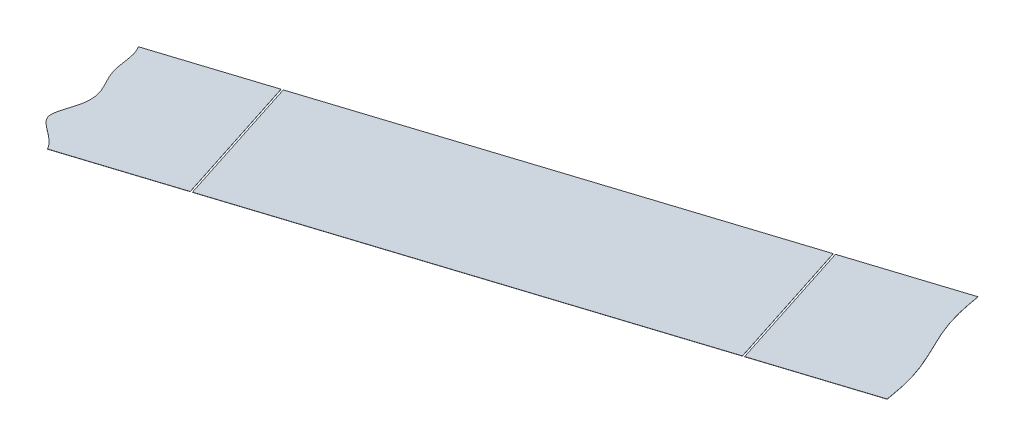
ISO-10303-21;
HEADER;
FILE_DESCRIPTION(('STEP AP214'),'2;1');
FILE_NAME('part.step','',(''),(''),'','','');
FILE_SCHEMA(('AUTOMOTIVE_DESIGN { 1 0 10303 214 1 1 1 1 }'));
ENDSEC;
DATA;
#1=APPLICATION_CONTEXT('core data for automotive mechanical design processes');
#2=APPLICATION_PROTOCOL_DEFINITION('international standard','automotive_design',2000,#1);
#3=PRODUCT_CONTEXT('',#1,'mechanical');
#4=PRODUCT('Part','Part','',(#3));
#5=PRODUCT_RELATED_PRODUCT_CATEGORY('part','',(#4));
#6=PRODUCT_DEFINITION_FORMATION('','',#4);
#7=PRODUCT_DEFINITION_CONTEXT('part definition',#1,'design');
#8=PRODUCT_DEFINITION('design','',#6,#7);
#9=PRODUCT_DEFINITION_SHAPE('','',#8);
#10=(LENGTH_UNIT() NAMED_UNIT(*) SI_UNIT(.MILLI.,.METRE.));
#11=(NAMED_UNIT(*) PLANE_ANGLE_UNIT() SI_UNIT($,.RADIAN.));
#12=(NAMED_UNIT(*) SI_UNIT($,.STERADIAN.) SOLID_ANGLE_UNIT());
#13=UNCERTAINTY_MEASURE_WITH_UNIT(LENGTH_MEASURE(1.E-05),#10,'distance_accuracy_value','');
#14=(GEOMETRIC_REPRESENTATION_CONTEXT(3) GLOBAL_UNCERTAINTY_ASSIGNED_CONTEXT((#13)) GLOBAL_UNIT_ASSIGNED_CONTEXT((#10,
#11,#12)) REPRESENTATION_CONTEXT('',''));
#15=CARTESIAN_POINT('',(0.,0.,0.));
#16=DIRECTION('',(0.,0.,1.));
#17=DIRECTION('',(1.,0.,0.));
#18=AXIS2_PLACEMENT_3D('',#15,#16,#17);
#19=CARTESIAN_POINT('',(719.344625514833,60.3000999940948,-202.533394104968));
#20=DIRECTION('',(0.304317580977551,-0.00396825396825686,0.952562366917996));
#21=DIRECTION('',(0.952569867025211,0.,-0.304319977056342));
#22=AXIS2_PLACEMENT_3D('',#19,#20,#21);
#23=PLANE('',#22);
#24=DIRECTION('',(0.00120761895657136,0.999992126449225,0.00378003915485746));
#25=VECTOR('',#24,1.);
#26=CARTESIAN_POINT('',(1017.77966003325,50.4001779422475,-297.916453885646));
#27=LINE('',#26,#25);
#28=CARTESIAN_POINT('',(1017.79161546092,60.3000999940948,-297.879031498012));
#29=VERTEX_POINT('',#28);
#30=CARTESIAN_POINT('',(1017.79173622281,60.4000992067397,-297.878653494097));
#31=VERTEX_POINT('',#30);
#32=EDGE_CURVE('E65',#29,#31,#27,.T.);
#33=ORIENTED_EDGE('',*,*,#32,.T.);
#34=DIRECTION('',(0.952569867025211,0.,-0.304319977056342));
#35=VECTOR('',#34,1.);
#36=CARTESIAN_POINT('',(719.344746276728,60.4000992067398,-202.533016101052));
#37=LINE('',#36,#35);
#38=CARTESIAN_POINT('',(781.554409200559,60.4000992067398,-222.407299184124));
#39=VERTEX_POINT('',#38);
#40=EDGE_CURVE('E100',#39,#31,#37,.T.);
#41=ORIENTED_EDGE('',*,*,#40,.F.);
#42=DIRECTION('',(0.00120761895657136,0.999992126449225,0.00378003915485746));
#43=VECTOR('',#42,1.);
#44=CARTESIAN_POINT('',(781.542333010994,50.4001779422475,-222.445099575673));
#45=LINE('',#44,#43);
#46=CARTESIAN_POINT('',(781.554288438664,60.3000999940948,-222.407677188039));
#47=VERTEX_POINT('',#46);
#48=EDGE_CURVE('E115',#47,#39,#45,.T.);
#49=ORIENTED_EDGE('',*,*,#48,.F.);
#50=DIRECTION('',(0.952569867025211,0.,-0.304319977056342));
#51=VECTOR('',#50,1.);
#52=CARTESIAN_POINT('',(719.344625514833,60.3000999940948,-202.533394104968));
#53=LINE('',#52,#51);
#54=EDGE_CURVE('E53',#47,#29,#53,.T.);
#55=ORIENTED_EDGE('',*,*,#54,.T.);
#56=EDGE_LOOP('',(#33,#41,#49,#55));
#57=FACE_BOUND('',#56,.T.);
#58=ADVANCED_FACE('F50',(#57),#23,.T.);
#59=CARTESIAN_POINT('',(695.210675421734,60.6151075220585,-278.157063700866));
#60=DIRECTION('',(0.304317580977552,-0.00396825396825686,0.952562366917996));
#61=DIRECTION('',(0.95256986702521,0.,-0.304319977056343));
#62=AXIS2_PLACEMENT_3D('',#59,#60,#61);
#63=PLANE('',#62);
#64=DIRECTION('',(0.95256986702521,0.,-0.304319977056343));
#65=VECTOR('',#64,1.);
#66=CARTESIAN_POINT('',(695.21079618363,60.7151067347034,-278.15668569695));
#67=LINE('',#66,#65);
#68=CARTESIAN_POINT('',(757.397102317828,60.7151067347034,-298.023506925589));
#69=VERTEX_POINT('',#68);
#70=CARTESIAN_POINT('',(993.634429340078,60.7151067347034,-373.494861235561));
#71=VERTEX_POINT('',#70);
#72=EDGE_CURVE('E98',#69,#71,#67,.T.);
#73=ORIENTED_EDGE('',*,*,#72,.T.);
#74=DIRECTION('',(0.00120761895657136,0.999992126449225,0.00378003915485746));
#75=VECTOR('',#74,1.);
#76=CARTESIAN_POINT('',(993.622353150515,50.7151854702111,-373.532661627111));
#77=LINE('',#76,#75);
#78=CARTESIAN_POINT('',(993.634308578185,60.6151075220585,-373.495239239478));
#79=VERTEX_POINT('',#78);
#80=EDGE_CURVE('E59',#79,#71,#77,.T.);
#81=ORIENTED_EDGE('',*,*,#80,.F.);
#82=DIRECTION('',(0.95256986702521,0.,-0.304319977056343));
#83=VECTOR('',#82,1.);
#84=CARTESIAN_POINT('',(695.210675421734,60.6151075220585,-278.157063700866));
#85=LINE('',#84,#83);
#86=CARTESIAN_POINT('',(757.396981555932,60.6151075220585,-298.023884929505));
#87=VERTEX_POINT('',#86);
#88=EDGE_CURVE('E104',#87,#79,#85,.T.);
#89=ORIENTED_EDGE('',*,*,#88,.F.);
#90=DIRECTION('',(0.00120761895657136,0.999992126449225,0.00378003915485746));
#91=VECTOR('',#90,1.);
#92=CARTESIAN_POINT('',(757.385026128262,50.7151854702111,-298.061307317138));
#93=LINE('',#92,#91);
#94=EDGE_CURVE('E103',#87,#69,#93,.T.);
#95=ORIENTED_EDGE('',*,*,#94,.T.);
#96=EDGE_LOOP('',(#73,#81,#89,#95));
#97=FACE_BOUND('',#96,.T.);
#98=ADVANCED_FACE('F102',(#97),#63,.F.);
#99=CARTESIAN_POINT('',(5838.61778854749,45.2761310138992,2136.52157608123));
#100=DIRECTION('',(-0.00120761895657136,-0.999992126449225,-0.00378003915485746));
#101=DIRECTION('',(0.,0.00378004191115832,-0.999992855616054));
#102=AXIS2_PLACEMENT_3D('',#99,#100,#101);
#103=PLANE('',#102);
#104=DIRECTION('',(-0.304317580977555,0.00396825396824926,-0.952562366917995));
#105=VECTOR('',#104,1.);
#106=CARTESIAN_POINT('',(2169.9502054395,45.2761310138992,3308.56036648025));
#107=LINE('',#106,#105);
#108=EDGE_CURVE('E87',#29,#79,#107,.T.);
#109=ORIENTED_EDGE('',*,*,#108,.F.);
#110=ORIENTED_EDGE('',*,*,#54,.F.);
#111=DIRECTION('',(0.304317580977553,-0.00396825396824926,0.952562366917996));
#112=VECTOR('',#111,1.);
#113=CARTESIAN_POINT('',(1933.71287841723,45.2761310138992,3384.03172079022));
#114=LINE('',#113,#112);
#115=EDGE_CURVE('E109',#87,#47,#114,.T.);
#116=ORIENTED_EDGE('',*,*,#115,.F.);
#117=ORIENTED_EDGE('',*,*,#88,.T.);
#118=EDGE_LOOP('',(#109,#110,#116,#117));
#119=FACE_BOUND('',#118,.T.);
#120=ADVANCED_FACE('F124',(#119),#103,.T.);
#121=CARTESIAN_POINT('',(5838.61790930938,45.3761302265441,2136.52195408514));
#122=DIRECTION('',(-0.00120761895657136,-0.999992126449225,-0.00378003915485746));
#123=DIRECTION('',(0.,0.00378004191115832,-0.999992855616054));
#124=AXIS2_PLACEMENT_3D('',#121,#122,#123);
#125=PLANE('',#124);
#126=ORIENTED_EDGE('',*,*,#40,.T.);
#127=DIRECTION('',(0.304317580977555,-0.00396825396824926,0.952562366917995));
#128=VECTOR('',#127,1.);
#129=CARTESIAN_POINT('',(1017.79173622281,60.4000992067397,-297.878653494097));
#130=LINE('',#129,#128);
#131=EDGE_CURVE('E14',#71,#31,#130,.T.);
#132=ORIENTED_EDGE('',*,*,#131,.F.);
#133=ORIENTED_EDGE('',*,*,#72,.F.);
#134=DIRECTION('',(-0.304317580977553,0.00396825396824926,-0.952562366917996));
#135=VECTOR('',#134,1.);
#136=CARTESIAN_POINT('',(781.554409200559,60.4000992067397,-222.407299184124));
#137=LINE('',#136,#135);
#138=EDGE_CURVE('E113',#39,#69,#137,.T.);
#139=ORIENTED_EDGE('',*,*,#138,.F.);
#140=EDGE_LOOP('',(#126,#132,#133,#139));
#141=FACE_BOUND('',#140,.T.);
#142=ADVANCED_FACE('F96',(#141),#125,.F.);
#143=CARTESIAN_POINT('',(781.542333010994,50.4001779422475,-222.445099575673));
#144=DIRECTION('',(0.95256986702521,0.,-0.304319977056344));
#145=DIRECTION('',(-0.304319977056344,0.,-0.95256986702521));
#146=AXIS2_PLACEMENT_3D('',#143,#144,#145);
#147=PLANE('',#146);
#148=ORIENTED_EDGE('',*,*,#115,.T.);
#149=ORIENTED_EDGE('',*,*,#48,.T.);
#150=ORIENTED_EDGE('',*,*,#138,.T.);
#151=ORIENTED_EDGE('',*,*,#94,.F.);
#152=EDGE_LOOP('',(#148,#149,#150,#151));
#153=FACE_BOUND('',#152,.T.);
#154=ADVANCED_FACE('F118',(#153),#147,.F.);
#155=CARTESIAN_POINT('',(1017.77966003325,50.4001779422475,-297.916453885646));
#156=DIRECTION('',(-0.952569867025209,0.,0.304319977056347));
#157=DIRECTION('',(0.304319977056347,0.,0.952569867025209));
#158=AXIS2_PLACEMENT_3D('',#155,#156,#157);
#159=PLANE('',#158);
#160=ORIENTED_EDGE('',*,*,#108,.T.);
#161=ORIENTED_EDGE('',*,*,#80,.T.);
#162=ORIENTED_EDGE('',*,*,#131,.T.);
#163=ORIENTED_EDGE('',*,*,#32,.F.);
#164=EDGE_LOOP('',(#160,#161,#162,#163));
#165=FACE_BOUND('',#164,.T.);
#166=ADVANCED_FACE('F86',(#165),#159,.F.);
#167=CLOSED_SHELL('',(#58,#98,#120,#142,#154,#166));
#168=MANIFOLD_SOLID_BREP('B2',#167);
#169=CARTESIAN_POINT('',(1079.99140488339,60.3000999940948,-317.750160267882));
#170=CARTESIAN_POINT('',(1079.92356731361,60.3016833300024,-318.147352319159));
#171=CARTESIAN_POINT('',(1079.88592274932,60.302560990407,-318.367506971225));
#172=CARTESIAN_POINT('',(1079.82759921111,60.3039207686674,-318.708597338534));
#173=CARTESIAN_POINT('',(1079.6629901955,60.3077470702284,-319.668239902551));
#174=CARTESIAN_POINT('',(1079.56738179669,60.3099439793437,-320.218877929771));
#175=CARTESIAN_POINT('',(1079.4534072909,60.3125629085778,-320.875291987508));
#176=CARTESIAN_POINT('',(1079.2372613917,60.3174379505536,-322.095909424955));
#177=CARTESIAN_POINT('',(1079.01470139131,60.3223330649001,-323.31978778697));
#178=CARTESIAN_POINT('',(1078.78471813555,60.3272373684285,-324.543725578401));
#179=CARTESIAN_POINT('',(1078.54608484687,60.3321466282667,-325.766211090459));
#180=CARTESIAN_POINT('',(1078.29755977005,60.3370588524091,-326.986320640341));
#181=CARTESIAN_POINT('',(1078.03795514102,60.3419729787801,-328.203393802748));
#182=CARTESIAN_POINT('',(1077.76617004206,60.3468883860321,-329.41691448989));
#183=CARTESIAN_POINT('',(1077.48121024744,60.3518046839513,-330.626461844639));
#184=CARTESIAN_POINT('',(1077.1822022832,60.3567216125842,-331.8316880465));
#185=CARTESIAN_POINT('',(1076.70917971619,60.3641341193159,-333.641515159357));
#186=CARTESIAN_POINT('',(1076.0208396841,60.3739451996138,-336.017085943317));
#187=CARTESIAN_POINT('',(1075.26769485035,60.3837575162598,-338.372280438731));
#188=CARTESIAN_POINT('',(1074.44996452213,60.3935685446923,-340.706500846949));
#189=CARTESIAN_POINT('',(1073.78512303586,60.4009815517373,-342.455179425547));
#190=CARTESIAN_POINT('',(1073.329412452,60.4058984586714,-343.610337692954));
#191=CARTESIAN_POINT('',(1072.85978452213,60.4108147266564,-344.760880718478));
#192=CARTESIAN_POINT('',(1072.37715838271,60.4157300909802,-345.907032112702));
#193=CARTESIAN_POINT('',(1071.8825937921,60.4206441544026,-347.049025351276));
#194=CARTESIAN_POINT('',(1071.3772928193,60.4255562832954,-348.187076838887));
#195=CARTESIAN_POINT('',(1070.86261301468,60.4304653896327,-349.321332443359));
#196=CARTESIAN_POINT('',(1070.34011124145,60.4353694267305,-350.451748098962));
#197=CARTESIAN_POINT('',(1069.81168243625,60.4402640174031,-351.577771221494));
#198=CARTESIAN_POINT('',(1069.28006144664,60.4451377893256,-352.697267023127));
#199=CARTESIAN_POINT('',(1068.9919502105,60.4477597728278,-353.298857158652));
#200=CARTESIAN_POINT('',(1068.75138408943,60.449949067522,-353.801170804307));
#201=CARTESIAN_POINT('',(1068.32905430806,60.4537755912147,-354.678537407834));
#202=CARTESIAN_POINT('',(1068.17799433948,60.4551427617644,-354.991956622563));
#203=CARTESIAN_POINT('',(1068.0873616748,60.4559630340786,-355.180001270407));
#204=CARTESIAN_POINT('',(1067.72468831673,60.4592442070787,-355.93215642725));
#205=CARTESIAN_POINT('',(1067.63402525629,60.4600647543889,-356.120264113436));
#206=CARTESIAN_POINT('',(1067.48300748786,60.4614315428368,-356.433595726687));
#207=CARTESIAN_POINT('',(1067.06067683788,60.4652580735141,-357.310963900446));
#208=CARTESIAN_POINT('',(1066.82006938527,60.4674477433255,-357.813363577347));
#209=CARTESIAN_POINT('',(1066.53200054539,60.47006933977,-358.414864862977));
#210=CARTESIAN_POINT('',(1066.00037945576,60.4749431091752,-359.534359966716));
#211=CARTESIAN_POINT('',(1065.47195031925,60.4798376983412,-360.660382584824));
#212=CARTESIAN_POINT('',(1064.94944797629,60.4847417350319,-361.790797950729));
#213=CARTESIAN_POINT('',(1064.4347674564,60.4896508413302,-362.92505331638));
#214=CARTESIAN_POINT('',(1063.92946574685,60.4945629693647,-364.063104341555));
#215=CARTESIAN_POINT('',(1063.43490020782,60.4994770330706,-365.205097352133));
#216=CARTESIAN_POINT('',(1062.95227307474,60.5043923972883,-366.351248400839));
#217=CARTESIAN_POINT('',(1062.48264414247,60.5093086644364,-367.501790884737));
#218=CARTESIAN_POINT('',(1062.0269323984,60.5142255714735,-368.656948808725));
#219=CARTESIAN_POINT('',(1061.36208893136,60.5216385803938,-370.405627250608));
#220=CARTESIAN_POINT('',(1060.54435610389,60.5314496083031,-372.739846721993));
#221=CARTESIAN_POINT('',(1060.16397946662,60.5364053126219,-373.929335792816));
#222=CARTESIAN_POINT('',(1059.78438470949,60.541355166725,-375.117527005026));
#223=CARTESIAN_POINT('',(1059.09747523144,60.5511538824545,-377.49028382164));
#224=CARTESIAN_POINT('',(1058.62538400703,60.5585571754946,-379.297971032823));
#225=CARTESIAN_POINT('',(1058.32695367193,60.5634678823263,-380.501735822206));
#226=CARTESIAN_POINT('',(1058.04252521818,60.5683779588772,-381.709807091212));
#227=CARTESIAN_POINT('',(1057.77122686158,60.5732871456886,-382.921837689992));
#228=CARTESIAN_POINT('',(1057.51206681671,60.5781950531181,-384.137407692222));
#229=CARTESIAN_POINT('',(1057.26394729478,60.5831010605401,-385.356002200751));
#230=CARTESIAN_POINT('',(1057.02568430833,60.5880041065988,-386.576962187189));
#231=CARTESIAN_POINT('',(1056.79604032832,60.5929022025628,-387.799366185074));
#232=CARTESIAN_POINT('',(1056.57379311948,60.5977911233178,-389.021705988998));
#233=CARTESIAN_POINT('',(1056.35793824322,60.6026599993398,-390.240785225326));
#234=CARTESIAN_POINT('',(1056.24409524255,60.605276004015,-390.896467616645));
#235=CARTESIAN_POINT('',(1056.14862772689,60.6074697573931,-391.446315816256));
#236=CARTESIAN_POINT('',(1055.98422840238,60.6112912203507,-392.404745340394));
#237=CARTESIAN_POINT('',(1055.92596316092,60.6126496425476,-392.745495591502));
#238=CARTESIAN_POINT('',(1055.88837479347,60.6135259947504,-392.965322118084));
#239=CARTESIAN_POINT('',(1055.82061471238,60.6151075220585,-393.362060468117));
#240=B_SPLINE_CURVE_WITH_KNOTS('',2,(#169,#170,#171,#172,#173,#174,#175,#176,#177,#178,#179,
#180,#181,#182,#183,#184,#185,#186,#187,#188,#189,#190,#191,#192,#193,#194,#195,#196,#197,#198,
#199,#200,#201,#202,#203,#204,#205,#206,#207,#208,#209,#210,#211,#212,#213,#214,#215,#216,#217,
#218,#219,#220,#221,#222,#223,#224,#225,#226,#227,#228,#229,#230,#231,#232,#233,#234,#235,#236,
#237,#238,#239),.UNSPECIFIED.,.F.,.F.,(3,2,1,2,1,1,1,1,1,1,1,1,1,1,1,1,1,1,1,1,1,1,1,1,1,1,1,2,
1,2,1,2,1,2,1,1,1,1,1,1,1,1,1,1,1,1,1,1,1,1,1,1,1,1,1,1,1,1,2,1,2,3),(0.,0.0078125,0.015625,
0.03125,0.046875,0.0625,0.078125,0.09375,0.109375,0.125,0.140625,0.15625,0.171875,0.1875,
0.21875,0.25,0.28125,0.3125,0.328125,0.34375,0.359375,0.375,0.390625,0.40625,0.421875,0.4375,
0.453125,0.46875,0.484375,0.4921875,0.5,0.5078125,0.515625,0.53125,0.546875,0.5625,0.578125,
0.59375,0.609375,0.625,0.640625,0.65625,0.671875,0.6875,0.71875,0.75,0.750316619873047,
0.781527042388916,0.812737464904785,0.82834267616272,0.843947887420654,0.859553098678589,
0.875158309936523,0.890763521194458,0.906368732452393,0.921973943710327,0.937579154968262,
0.953184366226196,0.968789577484131,0.984394788742065,0.992197394371033,1.),.UNSPECIFIED.);
#241=DIRECTION('',(0.00120761895657293,0.999992126449225,0.00378003915486494));
#242=VECTOR('',#241,1.);
#243=SURFACE_OF_LINEAR_EXTRUSION('',#240,#242);
#244=CARTESIAN_POINT('',(1079.99152564528,60.4000992067397,-317.749782263967));
#245=CARTESIAN_POINT('',(1079.9236880755,60.4016825426473,-318.146974315243));
#246=CARTESIAN_POINT('',(1079.88604351121,60.402560203052,-318.367128967309));
#247=CARTESIAN_POINT('',(1079.82771997301,60.4039199813124,-318.708219334618));
#248=CARTESIAN_POINT('',(1079.6631109574,60.4077462828733,-319.667861898636));
#249=CARTESIAN_POINT('',(1079.56750255858,60.4099431919886,-320.218499925855));
#250=CARTESIAN_POINT('',(1079.45352805279,60.4125621212227,-320.874913983593));
#251=CARTESIAN_POINT('',(1079.2373821536,60.4174371631985,-322.09553142104));
#252=CARTESIAN_POINT('',(1079.0148221532,60.4223322775451,-323.319409783055));
#253=CARTESIAN_POINT('',(1078.78483889744,60.4272365810734,-324.543347574485));
#254=CARTESIAN_POINT('',(1078.54620560877,60.4321458409116,-325.765833086543));
#255=CARTESIAN_POINT('',(1078.29768053195,60.437058065054,-326.985942636426));
#256=CARTESIAN_POINT('',(1078.03807590292,60.4419721914251,-328.203015798833));
#257=CARTESIAN_POINT('',(1077.76629080396,60.446887598677,-329.416536485975));
#258=CARTESIAN_POINT('',(1077.48133100934,60.4518038965962,-330.626083840723));
#259=CARTESIAN_POINT('',(1077.18232304509,60.4567208252291,-331.831310042584));
#260=CARTESIAN_POINT('',(1076.70930047809,60.4641333319608,-333.641137155442));
#261=CARTESIAN_POINT('',(1076.020960446,60.4739444122587,-336.016707939402));
#262=CARTESIAN_POINT('',(1075.26781561225,60.4837567289047,-338.371902434816));
#263=CARTESIAN_POINT('',(1074.45008528402,60.4935677573372,-340.706122843033));
#264=CARTESIAN_POINT('',(1073.78524379776,60.5009807643822,-342.454801421631));
#265=CARTESIAN_POINT('',(1073.3295332139,60.5058976713163,-343.609959689038));
#266=CARTESIAN_POINT('',(1072.85990528403,60.5108139393013,-344.760502714563));
#267=CARTESIAN_POINT('',(1072.37727914461,60.5157293036251,-345.906654108786));
#268=CARTESIAN_POINT('',(1071.882714554,60.5206433670475,-347.04864734736));
#269=CARTESIAN_POINT('',(1071.37741358119,60.5255554959404,-348.186698834972));
#270=CARTESIAN_POINT('',(1070.86273377657,60.5304646022776,-349.320954439444));
#271=CARTESIAN_POINT('',(1070.34023200334,60.5353686393754,-350.451370095046));
#272=CARTESIAN_POINT('',(1069.81180319814,60.540263230048,-351.577393217578));
#273=CARTESIAN_POINT('',(1069.28018220854,60.5451370019706,-352.696889019212));
#274=CARTESIAN_POINT('',(1068.9920709724,60.5477589854727,-353.298479154736));
#275=CARTESIAN_POINT('',(1068.75150485132,60.5499482801669,-353.800792800392));
#276=CARTESIAN_POINT('',(1068.32917506996,60.5537748038597,-354.678159403918));
#277=CARTESIAN_POINT('',(1068.17811510138,60.5551419744093,-354.991578618648));
#278=CARTESIAN_POINT('',(1068.08748243669,60.5559622467235,-355.179623266491));
#279=CARTESIAN_POINT('',(1067.72480907863,60.5592434197236,-355.931778423335));
#280=CARTESIAN_POINT('',(1067.63414601818,60.5600639670338,-356.11988610952));
#281=CARTESIAN_POINT('',(1067.48312824975,60.5614307554817,-356.433217722771));
#282=CARTESIAN_POINT('',(1067.06079759978,60.565257286159,-357.31058589653));
#283=CARTESIAN_POINT('',(1066.82019014716,60.5674469559704,-357.812985573432));
#284=CARTESIAN_POINT('',(1066.53212130729,60.5700685524149,-358.414486859061));
#285=CARTESIAN_POINT('',(1066.00050021766,60.5749423218201,-359.533981962801));
#286=CARTESIAN_POINT('',(1065.47207108115,60.5798369109861,-360.660004580908));
#287=CARTESIAN_POINT('',(1064.94956873819,60.5847409476768,-361.790419946813));
#288=CARTESIAN_POINT('',(1064.4348882183,60.5896500539751,-362.924675312465));
#289=CARTESIAN_POINT('',(1063.92958650875,60.5945621820096,-364.062726337639));
#290=CARTESIAN_POINT('',(1063.43502096971,60.5994762457155,-365.204719348217));
#291=CARTESIAN_POINT('',(1062.95239383664,60.6043916099332,-366.350870396923));
#292=CARTESIAN_POINT('',(1062.48276490436,60.6093078770814,-367.501412880822));
#293=CARTESIAN_POINT('',(1062.0270531603,60.6142247841185,-368.65657080481));
#294=CARTESIAN_POINT('',(1061.36220969326,60.6216377930387,-370.405249246692));
#295=CARTESIAN_POINT('',(1060.54447686579,60.631448820948,-372.739468718078));
#296=CARTESIAN_POINT('',(1060.16410022852,60.6364045252668,-373.928957788901));
#297=CARTESIAN_POINT('',(1059.78450547139,60.6413543793699,-375.11714900111));
#298=CARTESIAN_POINT('',(1059.09759599334,60.6511530950995,-377.489905817725));
#299=CARTESIAN_POINT('',(1058.62550476893,60.6585563881395,-379.297593028908));
#300=CARTESIAN_POINT('',(1058.32707443383,60.6634670949712,-380.50135781829));
#301=CARTESIAN_POINT('',(1058.04264598007,60.6683771715222,-381.709429087296));
#302=CARTESIAN_POINT('',(1057.77134762347,60.6732863583335,-382.921459686076));
#303=CARTESIAN_POINT('',(1057.5121875786,60.678194265763,-384.137029688306));
#304=CARTESIAN_POINT('',(1057.26406805668,60.683100273185,-385.355624196835));
#305=CARTESIAN_POINT('',(1057.02580507022,60.6880033192437,-386.576584183274));
#306=CARTESIAN_POINT('',(1056.79616109022,60.6929014152077,-387.798988181159));
#307=CARTESIAN_POINT('',(1056.57391388138,60.6977903359627,-389.021327985083));
#308=CARTESIAN_POINT('',(1056.35805900512,60.7026592119847,-390.24040722141));
#309=CARTESIAN_POINT('',(1056.24421600444,60.70527521666,-390.896089612729));
#310=CARTESIAN_POINT('',(1056.14874848879,60.707468970038,-391.44593781234));
#311=CARTESIAN_POINT('',(1055.98434916427,60.7112904329956,-392.404367336479));
#312=CARTESIAN_POINT('',(1055.92608392282,60.7126488551925,-392.745117587586));
#313=CARTESIAN_POINT('',(1055.88849555536,60.7135252073954,-392.964944114168));
#314=CARTESIAN_POINT('',(1055.82073547428,60.7151067347034,-393.361682464201));
#315=B_SPLINE_CURVE_WITH_KNOTS('',2,(#244,#245,#246,#247,#248,#249,#250,#251,#252,#253,#254,
#255,#256,#257,#258,#259,#260,#261,#262,#263,#264,#265,#266,#267,#268,#269,#270,#271,#272,#273,
#274,#275,#276,#277,#278,#279,#280,#281,#282,#283,#284,#285,#286,#287,#288,#289,#290,#291,#292,
#293,#294,#295,#296,#297,#298,#299,#300,#301,#302,#303,#304,#305,#306,#307,#308,#309,#310,#311,
#312,#313,#314),.UNSPECIFIED.,.F.,.F.,(3,2,1,2,1,1,1,1,1,1,1,1,1,1,1,1,1,1,1,1,1,1,1,1,1,1,1,2,
1,2,1,2,1,2,1,1,1,1,1,1,1,1,1,1,1,1,1,1,1,1,1,1,1,1,1,1,1,1,2,1,2,3),(0.,0.0078125,0.015625,
0.03125,0.046875,0.0625,0.078125,0.09375,0.109375,0.125,0.140625,0.15625,0.171875,0.1875,
0.21875,0.25,0.28125,0.3125,0.328125,0.34375,0.359375,0.375,0.390625,0.40625,0.421875,0.4375,
0.453125,0.46875,0.484375,0.4921875,0.5,0.5078125,0.515625,0.53125,0.546875,0.5625,0.578125,
0.59375,0.609375,0.625,0.640625,0.65625,0.671875,0.6875,0.71875,0.75,0.750316619873047,
0.781527042388916,0.812737464904785,0.82834267616272,0.843947887420654,0.859553098678589,
0.875158309936523,0.890763521194458,0.906368732452393,0.921973943710327,0.937579154968262,
0.953184366226196,0.968789577484131,0.984394788742065,0.992197394371033,1.),.UNSPECIFIED.);
#316=CARTESIAN_POINT('',(1079.99152564528,60.4000992067397,-317.749782263967));
#317=VERTEX_POINT('',#316);
#318=CARTESIAN_POINT('',(1055.82073547428,60.7151067347034,-393.361682464201));
#319=VERTEX_POINT('',#318);
#320=EDGE_CURVE('E244',#317,#319,#315,.T.);
#321=ORIENTED_EDGE('',*,*,#320,.F.);
#322=DIRECTION('',(0.00120761895657293,0.999992126449225,0.00378003915486494));
#323=VECTOR('',#322,1.);
#324=CARTESIAN_POINT('',(1079.99140488339,60.3000999940948,-317.750160267882));
#325=LINE('',#324,#323);
#326=CARTESIAN_POINT('',(1079.99140488339,60.3000999940948,-317.750160267882));
#327=VERTEX_POINT('',#326);
#328=EDGE_CURVE('E245',#327,#317,#325,.T.);
#329=ORIENTED_EDGE('',*,*,#328,.F.);
#330=CARTESIAN_POINT('',(1055.82061471238,60.6151075220585,-393.362060468116));
#331=VERTEX_POINT('',#330);
#332=EDGE_CURVE('E192',#327,#331,#240,.T.);
#333=ORIENTED_EDGE('',*,*,#332,.T.);
#334=DIRECTION('',(0.00120761895657293,0.999992126449225,0.00378003915486494));
#335=VECTOR('',#334,1.);
#336=CARTESIAN_POINT('',(1055.82061471238,60.6151075220585,-393.362060468116));
#337=LINE('',#336,#335);
#338=EDGE_CURVE('E48',#331,#319,#337,.T.);
#339=ORIENTED_EDGE('',*,*,#338,.T.);
#340=EDGE_LOOP('',(#321,#329,#333,#339));
#341=FACE_BOUND('',#340,.T.);
#342=ADVANCED_FACE('F183',(#341),#243,.T.);
#343=CARTESIAN_POINT('',(5838.61790930938,45.3761302265441,2136.52195408514));
#344=DIRECTION('',(-0.00120761895657136,-0.999992126449225,-0.00378003915485746));
#345=DIRECTION('',(0.,0.00378004191115832,-0.999992855616054));
#346=AXIS2_PLACEMENT_3D('',#343,#344,#345);
#347=PLANE('',#346);
#348=DIRECTION('',(0.95256986702521,0.,-0.304319977056343));
#349=VECTOR('',#348,1.);
#350=CARTESIAN_POINT('',(695.21079618363,60.7151067347034,-278.15668569695));
#351=LINE('',#350,#349);
#352=CARTESIAN_POINT('',(994.586999207105,60.7151067347034,-373.799181212618));
#353=VERTEX_POINT('',#352);
#354=EDGE_CURVE('E239',#353,#319,#351,.T.);
#355=ORIENTED_EDGE('',*,*,#354,.F.);
#356=DIRECTION('',(-0.304317580977554,0.00396825396824926,-0.952562366917995));
#357=VECTOR('',#356,1.);
#358=CARTESIAN_POINT('',(994.586999207105,60.7151067347034,-373.799181212618));
#359=LINE('',#358,#357);
#360=CARTESIAN_POINT('',(1018.74430608984,60.4000992067397,-298.182973471153));
#361=VERTEX_POINT('',#360);
#362=EDGE_CURVE('E231',#361,#353,#359,.T.);
#363=ORIENTED_EDGE('',*,*,#362,.F.);
#364=DIRECTION('',(0.952569867025211,0.,-0.304319977056342));
#365=VECTOR('',#364,1.);
#366=CARTESIAN_POINT('',(719.344746276728,60.4000992067398,-202.533016101052));
#367=LINE('',#366,#365);
#368=EDGE_CURVE('E187',#361,#317,#367,.T.);
#369=ORIENTED_EDGE('',*,*,#368,.T.);
#370=ORIENTED_EDGE('',*,*,#320,.T.);
#371=EDGE_LOOP('',(#355,#363,#369,#370));
#372=FACE_BOUND('',#371,.T.);
#373=ADVANCED_FACE('F242',(#372),#347,.F.);
#374=CARTESIAN_POINT('',(5838.61778854749,45.2761310138992,2136.52157608123));
#375=DIRECTION('',(-0.00120761895657136,-0.999992126449225,-0.00378003915485746));
#376=DIRECTION('',(0.,0.00378004191115832,-0.999992855616054));
#377=AXIS2_PLACEMENT_3D('',#374,#375,#376);
#378=PLANE('',#377);
#379=DIRECTION('',(0.304317580977554,-0.00396825396824926,0.952562366917995));
#380=VECTOR('',#379,1.);
#381=CARTESIAN_POINT('',(2170.90277530652,45.2761310138992,3308.25604650319));
#382=LINE('',#381,#380);
#383=CARTESIAN_POINT('',(994.58687844521,60.6151075220585,-373.799559216534));
#384=VERTEX_POINT('',#383);
#385=CARTESIAN_POINT('',(1018.74418532794,60.3000999940948,-298.183351475069));
#386=VERTEX_POINT('',#385);
#387=EDGE_CURVE('E229',#384,#386,#382,.T.);
#388=ORIENTED_EDGE('',*,*,#387,.F.);
#389=DIRECTION('',(0.95256986702521,0.,-0.304319977056343));
#390=VECTOR('',#389,1.);
#391=CARTESIAN_POINT('',(695.210675421734,60.6151075220585,-278.157063700866));
#392=LINE('',#391,#390);
#393=EDGE_CURVE('E240',#384,#331,#392,.T.);
#394=ORIENTED_EDGE('',*,*,#393,.T.);
#395=ORIENTED_EDGE('',*,*,#332,.F.);
#396=DIRECTION('',(0.952569867025211,0.,-0.304319977056342));
#397=VECTOR('',#396,1.);
#398=CARTESIAN_POINT('',(719.344625514833,60.3000999940948,-202.533394104968));
#399=LINE('',#398,#397);
#400=EDGE_CURVE('E221',#386,#327,#399,.T.);
#401=ORIENTED_EDGE('',*,*,#400,.F.);
#402=EDGE_LOOP('',(#388,#394,#395,#401));
#403=FACE_BOUND('',#402,.T.);
#404=ADVANCED_FACE('F265',(#403),#378,.T.);
#405=CARTESIAN_POINT('',(695.210675421734,60.6151075220585,-278.157063700866));
#406=DIRECTION('',(0.304317580977552,-0.00396825396825686,0.952562366917996));
#407=DIRECTION('',(0.95256986702521,0.,-0.304319977056343));
#408=AXIS2_PLACEMENT_3D('',#405,#406,#407);
#409=PLANE('',#408);
#410=ORIENTED_EDGE('',*,*,#393,.F.);
#411=DIRECTION('',(0.00120761895657136,0.999992126449225,0.00378003915485746));
#412=VECTOR('',#411,1.);
#413=CARTESIAN_POINT('',(994.57492301754,50.7151854702111,-373.836981604167));
#414=LINE('',#413,#412);
#415=EDGE_CURVE('E226',#384,#353,#414,.T.);
#416=ORIENTED_EDGE('',*,*,#415,.T.);
#417=ORIENTED_EDGE('',*,*,#354,.T.);
#418=ORIENTED_EDGE('',*,*,#338,.F.);
#419=EDGE_LOOP('',(#410,#416,#417,#418));
#420=FACE_BOUND('',#419,.T.);
#421=ADVANCED_FACE('F237',(#420),#409,.F.);
#422=CARTESIAN_POINT('',(719.344625514833,60.3000999940948,-202.533394104968));
#423=DIRECTION('',(0.304317580977551,-0.00396825396825686,0.952562366917996));
#424=DIRECTION('',(0.952569867025211,0.,-0.304319977056342));
#425=AXIS2_PLACEMENT_3D('',#422,#423,#424);
#426=PLANE('',#425);
#427=DIRECTION('',(0.00120761895657136,0.999992126449225,0.00378003915485746));
#428=VECTOR('',#427,1.);
#429=CARTESIAN_POINT('',(1018.73222990027,50.4001779422475,-298.220773862702));
#430=LINE('',#429,#428);
#431=EDGE_CURVE('E200',#386,#361,#430,.T.);
#432=ORIENTED_EDGE('',*,*,#431,.F.);
#433=ORIENTED_EDGE('',*,*,#400,.T.);
#434=ORIENTED_EDGE('',*,*,#328,.T.);
#435=ORIENTED_EDGE('',*,*,#368,.F.);
#436=EDGE_LOOP('',(#432,#433,#434,#435));
#437=FACE_BOUND('',#436,.T.);
#438=ADVANCED_FACE('F185',(#437),#426,.T.);
#439=CARTESIAN_POINT('',(994.57492301754,50.7151854702111,-373.836981604167));
#440=DIRECTION('',(0.95256986702521,0.,-0.304319977056346));
#441=DIRECTION('',(-0.304319977056346,0.,-0.95256986702521));
#442=AXIS2_PLACEMENT_3D('',#439,#440,#441);
#443=PLANE('',#442);
#444=ORIENTED_EDGE('',*,*,#387,.T.);
#445=ORIENTED_EDGE('',*,*,#431,.T.);
#446=ORIENTED_EDGE('',*,*,#362,.T.);
#447=ORIENTED_EDGE('',*,*,#415,.F.);
#448=EDGE_LOOP('',(#444,#445,#446,#447));
#449=FACE_BOUND('',#448,.T.);
#450=ADVANCED_FACE('F232',(#449),#443,.F.);
#451=CLOSED_SHELL('',(#342,#373,#404,#421,#438,#450));
#452=MANIFOLD_SOLID_BREP('B8',#451);
#453=CARTESIAN_POINT('',(695.210675421732,60.6151075220585,-278.157063700867));
#454=CARTESIAN_POINT('',(695.899400305709,60.6099920194587,-277.023809540952));
#455=CARTESIAN_POINT('',(696.939091045038,60.599637418658,-274.616699811488));
#456=CARTESIAN_POINT('',(697.500778799902,60.5916302921774,-272.677894853302));
#457=CARTESIAN_POINT('',(697.802935271143,60.586401028439,-271.391047684866));
#458=CARTESIAN_POINT('',(698.050450275875,60.5812056870302,-270.095718062428));
#459=CARTESIAN_POINT('',(698.16141500711,60.5784422754316,-269.400120313285));
#460=CARTESIAN_POINT('',(698.255258947953,60.5761052316547,-268.811846604191));
#461=CARTESIAN_POINT('',(698.35672810981,60.5732431760181,-268.087119450179));
#462=CARTESIAN_POINT('',(698.423684262249,60.5713545999227,-267.608895910003));
#463=CARTESIAN_POINT('',(698.659259141536,60.5643555358705,-265.832585141866));
#464=CARTESIAN_POINT('',(698.711511827,60.5628544719046,-265.452178814089));
#465=CARTESIAN_POINT('',(698.81206797816,60.5599657932899,-264.720116990688));
#466=CARTESIAN_POINT('',(698.901107760142,60.5576710314676,-264.14149398279));
#467=CARTESIAN_POINT('',(699.009038011176,60.5548894184175,-263.440111689329));
#468=CARTESIAN_POINT('',(699.243760124328,60.5497267315821,-262.149333707039));
#469=CARTESIAN_POINT('',(699.524855482989,60.5445492879263,-260.869466856709));
#470=CARTESIAN_POINT('',(699.870809233552,60.5392036995634,-259.565838570075));
#471=CARTESIAN_POINT('',(700.273056773192,60.5339584928811,-258.30675012288));
#472=CARTESIAN_POINT('',(700.719132282943,60.5288647943595,-257.101744304741));
#473=CARTESIAN_POINT('',(701.229791210106,60.523661593357,-255.88840273704));
#474=CARTESIAN_POINT('',(701.785140086718,60.5184815938444,-254.695476232323));
#475=CARTESIAN_POINT('',(702.100662979266,60.5157156256539,-254.064552877162));
#476=CARTESIAN_POINT('',(702.364861277417,60.513399584232,-253.536258795697));
#477=CARTESIAN_POINT('',(702.704536573486,60.5105286861599,-252.88529274996));
#478=CARTESIAN_POINT('',(702.90634473922,60.5088230258406,-252.498540268502));
#479=CARTESIAN_POINT('',(703.736282357304,60.5018914738652,-250.929972125107));
#480=CARTESIAN_POINT('',(703.944816390693,60.5001272301338,-250.529870399498));
#481=CARTESIAN_POINT('',(704.283423224275,60.4972625419395,-249.880205804146));
#482=CARTESIAN_POINT('',(704.546403264742,60.4949511770884,-249.352759688188));
#483=CARTESIAN_POINT('',(704.862037315604,60.4921770294775,-248.719708016674));
#484=CARTESIAN_POINT('',(705.414529460395,60.4869905724773,-247.524160565496));
#485=CARTESIAN_POINT('',(705.917706475057,60.4817840431615,-246.307548241632));
#486=CARTESIAN_POINT('',(706.593539382874,60.4737898018873,-244.408618255428));
#487=CARTESIAN_POINT('',(707.15869260301,60.4634419279783,-241.85168635696));
#488=CARTESIAN_POINT('',(707.367207781742,60.4532912584865,-239.232987903869));
#489=CARTESIAN_POINT('',(707.230620671741,60.4434913774744,-236.596838216732));
#490=CARTESIAN_POINT('',(707.008634472681,60.4385768626871,-235.225807224091));
#491=CARTESIAN_POINT('',(706.809226987627,60.4341622142173,-233.994226867584));
#492=CARTESIAN_POINT('',(706.321759167841,60.4272334577979,-232.005523328459));
#493=CARTESIAN_POINT('',(705.972907089847,60.4228720732661,-230.740290250504));
#494=CARTESIAN_POINT('',(705.772460792333,60.4205732559596,-230.068111510764));
#495=CARTESIAN_POINT('',(705.605232548593,60.4186553997278,-229.507326544819));
#496=CARTESIAN_POINT('',(705.386839648048,60.4162731158541,-228.807333657206));
#497=CARTESIAN_POINT('',(705.281714235944,60.4151263818104,-228.470385704253));
#498=CARTESIAN_POINT('',(704.989288411093,60.4119799061617,-227.544577875067));
#499=CARTESIAN_POINT('',(704.733795764509,60.4092308281988,-226.735698930712));
#500=CARTESIAN_POINT('',(704.591590331564,60.4076553806186,-226.273490715191));
#501=CARTESIAN_POINT('',(704.372397141187,60.4052270108003,-225.56105033032));
#502=CARTESIAN_POINT('',(704.213654731494,60.4033086420386,-225.002840768445));
#503=CARTESIAN_POINT('',(704.015951511753,60.4009194400504,-224.307627511409));
#504=CARTESIAN_POINT('',(703.874944149044,60.3988809608491,-223.723309141933));
#505=CARTESIAN_POINT('',(703.706173296504,60.396441117524,-223.023942048795));
#506=CARTESIAN_POINT('',(703.602946018872,60.3942811855754,-222.419563610901));
#507=CARTESIAN_POINT('',(703.482616056965,60.3917633963334,-221.715051818304));
#508=CARTESIAN_POINT('',(703.399486667045,60.3868562764453,-220.390338059101));
#509=CARTESIAN_POINT('',(703.523039620997,60.3817509749865,-219.079225615665));
#510=CARTESIAN_POINT('',(703.901441686981,60.3765502547228,-217.824287872123));
#511=CARTESIAN_POINT('',(704.529356248249,60.3714107453651,-216.665255601633));
#512=CARTESIAN_POINT('',(705.341519456904,60.3664802662394,-215.620383721496));
#513=CARTESIAN_POINT('',(706.26656043442,60.3617849030411,-214.673772043024));
#514=CARTESIAN_POINT('',(706.803634661894,60.35934059926,-214.19872312317));
#515=CARTESIAN_POINT('',(707.257214924563,60.3572762887898,-213.79752566698));
#516=CARTESIAN_POINT('',(707.820787544453,60.3548725900462,-213.341684135135));
#517=CARTESIAN_POINT('',(708.27444129793,60.3529377072666,-212.974749662782));
#518=CARTESIAN_POINT('',(708.858316106923,60.3505329612471,-212.525117072115));
#519=CARTESIAN_POINT('',(709.264866045391,60.3488585452059,-212.212039509507));
#520=CARTESIAN_POINT('',(710.171341739665,60.3451761322113,-211.527468090325));
#521=CARTESIAN_POINT('',(710.696292334912,60.3430460824211,-211.131680462805));
#522=CARTESIAN_POINT('',(711.562918147693,60.3395161137087,-210.47470653806));
#523=CARTESIAN_POINT('',(712.019981778952,60.3376233833016,-210.120012646225));
#524=CARTESIAN_POINT('',(712.576686170522,60.3353180339856,-209.687994796316));
#525=CARTESIAN_POINT('',(713.590186341252,60.3309994360449,-208.869314938094));
#526=CARTESIAN_POINT('',(714.067018714901,60.328885079158,-208.462306342975));
#527=CARTESIAN_POINT('',(715.138163270078,60.3241354396781,-207.548012212237));
#528=CARTESIAN_POINT('',(716.015965935936,60.3197700948663,-206.673614046958));
#529=CARTESIAN_POINT('',(716.99726453703,60.3148900609773,-205.696121348703));
#530=CARTESIAN_POINT('',(718.660289891425,60.3051320912549,-203.645985984523));
#531=CARTESIAN_POINT('',(719.344625514831,60.3000999940948,-202.533394104968));
#532=B_SPLINE_CURVE_WITH_KNOTS('',2,(#453,#454,#455,#456,#457,#458,#459,#460,#461,#462,#463,
#464,#465,#466,#467,#468,#469,#470,#471,#472,#473,#474,#475,#476,#477,#478,#479,#480,#481,#482,
#483,#484,#485,#486,#487,#488,#489,#490,#491,#492,#493,#494,#495,#496,#497,#498,#499,#500,#501,
#502,#503,#504,#505,#506,#507,#508,#509,#510,#511,#512,#513,#514,#515,#516,#517,#518,#519,#520,
#521,#522,#523,#524,#525,#526,#527,#528,#529,#530,#531),.UNSPECIFIED.,.F.,.F.,(3,1,1,1,1,2,2,1,
2,2,1,1,1,1,1,1,1,2,2,1,2,2,1,1,1,1,1,1,2,1,1,2,2,2,2,2,2,2,1,1,1,1,1,1,2,2,2,1,1,1,2,1,2,2,1,
3),(0.,0.03125,0.0625,0.078125,0.09375,0.109375,0.125,0.140625,0.15625,0.171875,0.1875,0.203125,
0.21875,0.235114097595215,0.25,0.265625,0.28125,0.296875,0.3125,0.328125,0.34375,0.359375,0.375,
0.390625,0.40625,0.4375,0.46875,0.5,0.53125,0.5625,0.578125,0.59375,0.609375,0.625,0.640625,
0.65625,0.671875,0.6875,0.703125,0.71875,0.734375,0.75,0.765625,0.78125,0.796875,0.8125,
0.828125,0.84375,0.8515625,0.859375,0.875,0.890625,0.90625,0.9375,0.96875,1.),.UNSPECIFIED.);
#533=DIRECTION('',(0.00120761895657293,0.999992126449225,0.00378003915486494));
#534=VECTOR('',#533,1.);
#535=SURFACE_OF_LINEAR_EXTRUSION('',#532,#534);
#536=CARTESIAN_POINT('',(695.210796183628,60.7151067347034,-278.156685696951));
#537=CARTESIAN_POINT('',(695.899521067605,60.7099912321036,-277.023431537036));
#538=CARTESIAN_POINT('',(696.939211806934,60.6996366313029,-274.616321807573));
#539=CARTESIAN_POINT('',(697.500899561797,60.6916295048224,-272.677516849386));
#540=CARTESIAN_POINT('',(697.803056033039,60.686400241084,-271.39066968095));
#541=CARTESIAN_POINT('',(698.050571037771,60.6812048996752,-270.095340058513));
#542=CARTESIAN_POINT('',(698.161535769006,60.6784414880766,-269.399742309369));
#543=CARTESIAN_POINT('',(698.255379709849,60.6761044442997,-268.811468600275));
#544=CARTESIAN_POINT('',(698.356848871706,60.673242388663,-268.086741446263));
#545=CARTESIAN_POINT('',(698.423805024145,60.6713538125676,-267.608517906087));
#546=CARTESIAN_POINT('',(698.659379903431,60.6643547485155,-265.832207137951));
#547=CARTESIAN_POINT('',(698.711632588895,60.6628536845495,-265.451800810174));
#548=CARTESIAN_POINT('',(698.812188740056,60.6599650059348,-264.719738986773));
#549=CARTESIAN_POINT('',(698.901228522038,60.6576702441125,-264.141115978874));
#550=CARTESIAN_POINT('',(699.009158773071,60.6548886310624,-263.439733685414));
#551=CARTESIAN_POINT('',(699.243880886224,60.649725944227,-262.148955703123));
#552=CARTESIAN_POINT('',(699.524976244884,60.6445485005712,-260.869088852793));
#553=CARTESIAN_POINT('',(699.870929995448,60.6392029122083,-259.56546056616));
#554=CARTESIAN_POINT('',(700.273177535088,60.633957705526,-258.306372118965));
#555=CARTESIAN_POINT('',(700.719253044839,60.6288640070044,-257.101366300825));
#556=CARTESIAN_POINT('',(701.229911972002,60.6236608060019,-255.888024733125));
#557=CARTESIAN_POINT('',(701.785260848614,60.6184808064893,-254.695098228407));
#558=CARTESIAN_POINT('',(702.100783741161,60.6157148382988,-254.064174873246));
#559=CARTESIAN_POINT('',(702.364982039312,60.613398796877,-253.535880791782));
#560=CARTESIAN_POINT('',(702.704657335381,60.6105278988048,-252.884914746045));
#561=CARTESIAN_POINT('',(702.906465501115,60.6088222384855,-252.498162264587));
#562=CARTESIAN_POINT('',(703.7364031192,60.6018906865101,-250.929594121191));
#563=CARTESIAN_POINT('',(703.944937152588,60.6001264427787,-250.529492395583));
#564=CARTESIAN_POINT('',(704.283543986171,60.5972617545845,-249.879827800231));
#565=CARTESIAN_POINT('',(704.546524026638,60.5949503897333,-249.352381684273));
#566=CARTESIAN_POINT('',(704.8621580775,60.5921762421224,-248.719330012759));
#567=CARTESIAN_POINT('',(705.41465022229,60.5869897851222,-247.523782561581));
#568=CARTESIAN_POINT('',(705.917827236953,60.5817832558065,-246.307170237717));
#569=CARTESIAN_POINT('',(706.59366014477,60.5737890145323,-244.408240251512));
#570=CARTESIAN_POINT('',(707.158813364906,60.5634411406232,-241.851308353045));
#571=CARTESIAN_POINT('',(707.367328543637,60.5532904711314,-239.232609899954));
#572=CARTESIAN_POINT('',(707.230741433637,60.5434905901194,-236.596460212817));
#573=CARTESIAN_POINT('',(707.008755234577,60.5385760753321,-235.225429220175));
#574=CARTESIAN_POINT('',(706.809347749522,60.5341614268622,-233.993848863668));
#575=CARTESIAN_POINT('',(706.321879929737,60.5272326704429,-232.005145324543));
#576=CARTESIAN_POINT('',(705.973027851742,60.522871285911,-230.739912246588));
#577=CARTESIAN_POINT('',(705.772581554228,60.5205724686045,-230.067733506849));
#578=CARTESIAN_POINT('',(705.605353310489,60.5186546123727,-229.506948540903));
#579=CARTESIAN_POINT('',(705.386960409943,60.516272328499,-228.80695565329));
#580=CARTESIAN_POINT('',(705.28183499784,60.5151255944553,-228.470007700337));
#581=CARTESIAN_POINT('',(704.989409172989,60.5119791188067,-227.544199871151));
#582=CARTESIAN_POINT('',(704.733916526405,60.5092300408437,-226.735320926796));
#583=CARTESIAN_POINT('',(704.591711093459,60.5076545932636,-226.273112711275));
#584=CARTESIAN_POINT('',(704.372517903082,60.5052262234452,-225.560672326405));
#585=CARTESIAN_POINT('',(704.21377549339,60.5033078546835,-225.00246276453));
#586=CARTESIAN_POINT('',(704.016072273649,60.5009186526953,-224.307249507493));
#587=CARTESIAN_POINT('',(703.87506491094,60.498880173494,-223.722931138018));
#588=CARTESIAN_POINT('',(703.706294058399,60.4964403301689,-223.023564044879));
#589=CARTESIAN_POINT('',(703.603066780768,60.4942803982203,-222.419185606985));
#590=CARTESIAN_POINT('',(703.48273681886,60.4917626089783,-221.714673814389));
#591=CARTESIAN_POINT('',(703.399607428941,60.4868554890902,-220.389960055186));
#592=CARTESIAN_POINT('',(703.523160382892,60.4817501876314,-219.07884761175));
#593=CARTESIAN_POINT('',(703.901562448877,60.4765494673677,-217.823909868208));
#594=CARTESIAN_POINT('',(704.529477010144,60.47140995801,-216.664877597718));
#595=CARTESIAN_POINT('',(705.3416402188,60.4664794788843,-215.620005717581));
#596=CARTESIAN_POINT('',(706.266681196316,60.461784115686,-214.673394039108));
#597=CARTESIAN_POINT('',(706.80375542379,60.4593398119049,-214.198345119255));
#598=CARTESIAN_POINT('',(707.257335686458,60.4572755014347,-213.797147663065));
#599=CARTESIAN_POINT('',(707.820908306348,60.4548718026911,-213.34130613122));
#600=CARTESIAN_POINT('',(708.274562059826,60.4529369199116,-212.974371658866));
#601=CARTESIAN_POINT('',(708.858436868819,60.450532173892,-212.524739068199));
#602=CARTESIAN_POINT('',(709.264986807287,60.4488577578508,-212.211661505591));
#603=CARTESIAN_POINT('',(710.171462501561,60.4451753448562,-211.527090086409));
#604=CARTESIAN_POINT('',(710.696413096808,60.4430452950661,-211.131302458889));
#605=CARTESIAN_POINT('',(711.563038909588,60.4395153263536,-210.474328534144));
#606=CARTESIAN_POINT('',(712.020102540848,60.4376225959466,-210.119634642309));
#607=CARTESIAN_POINT('',(712.576806932418,60.4353172466306,-209.687616792401));
#608=CARTESIAN_POINT('',(713.590307103147,60.4309986486898,-208.868936934179));
#609=CARTESIAN_POINT('',(714.067139476796,60.4288842918029,-208.46192833906));
#610=CARTESIAN_POINT('',(715.138284031974,60.424134652323,-207.547634208322));
#611=CARTESIAN_POINT('',(716.016086697832,60.4197693075112,-206.673236043043));
#612=CARTESIAN_POINT('',(716.997385298925,60.4148892736223,-205.695743344787));
#613=CARTESIAN_POINT('',(718.660410653321,60.4051313038998,-203.645607980608));
#614=CARTESIAN_POINT('',(719.344746276727,60.4000992067397,-202.533016101053));
#615=B_SPLINE_CURVE_WITH_KNOTS('',2,(#536,#537,#538,#539,#540,#541,#542,#543,#544,#545,#546,
#547,#548,#549,#550,#551,#552,#553,#554,#555,#556,#557,#558,#559,#560,#561,#562,#563,#564,#565,
#566,#567,#568,#569,#570,#571,#572,#573,#574,#575,#576,#577,#578,#579,#580,#581,#582,#583,#584,
#585,#586,#587,#588,#589,#590,#591,#592,#593,#594,#595,#596,#597,#598,#599,#600,#601,#602,#603,
#604,#605,#606,#607,#608,#609,#610,#611,#612,#613,#614),.UNSPECIFIED.,.F.,.F.,(3,1,1,1,1,2,2,1,
2,2,1,1,1,1,1,1,1,2,2,1,2,2,1,1,1,1,1,1,2,1,1,2,2,2,2,2,2,2,1,1,1,1,1,1,2,2,2,1,1,1,2,1,2,2,1,
3),(0.,0.03125,0.0625,0.078125,0.09375,0.109375,0.125,0.140625,0.15625,0.171875,0.1875,0.203125,
0.21875,0.235114097595215,0.25,0.265625,0.28125,0.296875,0.3125,0.328125,0.34375,0.359375,0.375,
0.390625,0.40625,0.4375,0.46875,0.5,0.53125,0.5625,0.578125,0.59375,0.609375,0.625,0.640625,
0.65625,0.671875,0.6875,0.703125,0.71875,0.734375,0.75,0.765625,0.78125,0.796875,0.8125,
0.828125,0.84375,0.8515625,0.859375,0.875,0.890625,0.90625,0.9375,0.96875,1.),.UNSPECIFIED.);
#616=CARTESIAN_POINT('',(695.210796183628,60.7151067347034,-278.15668569695));
#617=VERTEX_POINT('',#616);
#618=CARTESIAN_POINT('',(719.344746276727,60.4000992067398,-202.533016101052));
#619=VERTEX_POINT('',#618);
#620=EDGE_CURVE('E362',#617,#619,#615,.T.);
#621=ORIENTED_EDGE('',*,*,#620,.F.);
#622=DIRECTION('',(0.00120761895657293,0.999992126449225,0.00378003915486494));
#623=VECTOR('',#622,1.);
#624=CARTESIAN_POINT('',(695.210675421733,60.6151075220585,-278.157063700865));
#625=LINE('',#624,#623);
#626=CARTESIAN_POINT('',(695.210675421733,60.6151075220585,-278.157063700865));
#627=VERTEX_POINT('',#626);
#628=EDGE_CURVE('E326',#627,#617,#625,.T.);
#629=ORIENTED_EDGE('',*,*,#628,.F.);
#630=CARTESIAN_POINT('',(719.344625514832,60.3000999940948,-202.533394104967));
#631=VERTEX_POINT('',#630);
#632=EDGE_CURVE('E378',#627,#631,#532,.T.);
#633=ORIENTED_EDGE('',*,*,#632,.T.);
#634=DIRECTION('',(0.00120761895657293,0.999992126449225,0.00378003915486494));
#635=VECTOR('',#634,1.);
#636=CARTESIAN_POINT('',(719.344625514832,60.3000999940948,-202.533394104967));
#637=LINE('',#636,#635);
#638=EDGE_CURVE('E181',#631,#619,#637,.T.);
#639=ORIENTED_EDGE('',*,*,#638,.T.);
#640=EDGE_LOOP('',(#621,#629,#633,#639));
#641=FACE_BOUND('',#640,.T.);
#642=ADVANCED_FACE('F318',(#641),#535,.T.);
#643=CARTESIAN_POINT('',(5838.61778854749,45.2761310138992,2136.52157608123));
#644=DIRECTION('',(-0.00120761895657136,-0.999992126449225,-0.00378003915485746));
#645=DIRECTION('',(0.,0.00378004191115832,-0.999992855616054));
#646=AXIS2_PLACEMENT_3D('',#643,#644,#645);
#647=PLANE('',#646);
#648=DIRECTION('',(-0.304317580977553,0.00396825396824926,-0.952562366917996));
#649=VECTOR('',#648,1.);
#650=CARTESIAN_POINT('',(1932.76030855021,45.2761310138992,3384.33604076727));
#651=LINE('',#650,#649);
#652=CARTESIAN_POINT('',(780.601718571638,60.3000999940948,-222.103357210983));
#653=VERTEX_POINT('',#652);
#654=CARTESIAN_POINT('',(756.444411688907,60.6151075220585,-297.719564952449));
#655=VERTEX_POINT('',#654);
#656=EDGE_CURVE('E369',#653,#655,#651,.T.);
#657=ORIENTED_EDGE('',*,*,#656,.F.);
#658=DIRECTION('',(0.952569867025211,0.,-0.304319977056342));
#659=VECTOR('',#658,1.);
#660=CARTESIAN_POINT('',(719.344625514833,60.3000999940948,-202.533394104968));
#661=LINE('',#660,#659);
#662=EDGE_CURVE('E364',#631,#653,#661,.T.);
#663=ORIENTED_EDGE('',*,*,#662,.F.);
#664=ORIENTED_EDGE('',*,*,#632,.F.);
#665=DIRECTION('',(0.95256986702521,0.,-0.304319977056343));
#666=VECTOR('',#665,1.);
#667=CARTESIAN_POINT('',(695.210675421734,60.6151075220585,-278.157063700866));
#668=LINE('',#667,#666);
#669=EDGE_CURVE('E356',#627,#655,#668,.T.);
#670=ORIENTED_EDGE('',*,*,#669,.T.);
#671=EDGE_LOOP('',(#657,#663,#664,#670));
#672=FACE_BOUND('',#671,.T.);
#673=ADVANCED_FACE('F389',(#672),#647,.T.);
#674=CARTESIAN_POINT('',(5838.61790930938,45.3761302265441,2136.52195408514));
#675=DIRECTION('',(-0.00120761895657136,-0.999992126449225,-0.00378003915485746));
#676=DIRECTION('',(0.,0.00378004191115832,-0.999992855616054));
#677=AXIS2_PLACEMENT_3D('',#674,#675,#676);
#678=PLANE('',#677);
#679=DIRECTION('',(0.952569867025211,0.,-0.304319977056342));
#680=VECTOR('',#679,1.);
#681=CARTESIAN_POINT('',(719.344746276728,60.4000992067398,-202.533016101052));
#682=LINE('',#681,#680);
#683=CARTESIAN_POINT('',(780.601839333534,60.4000992067397,-222.102979207068));
#684=VERTEX_POINT('',#683);
#685=EDGE_CURVE('E367',#619,#684,#682,.T.);
#686=ORIENTED_EDGE('',*,*,#685,.T.);
#687=DIRECTION('',(0.304317580977553,-0.00396825396824926,0.952562366917996));
#688=VECTOR('',#687,1.);
#689=CARTESIAN_POINT('',(756.444532450803,60.7151067347034,-297.719186948533));
#690=LINE('',#689,#688);
#691=CARTESIAN_POINT('',(756.444532450802,60.7151067347034,-297.719186948533));
#692=VERTEX_POINT('',#691);
#693=EDGE_CURVE('E363',#692,#684,#690,.T.);
#694=ORIENTED_EDGE('',*,*,#693,.F.);
#695=DIRECTION('',(0.95256986702521,0.,-0.304319977056343));
#696=VECTOR('',#695,1.);
#697=CARTESIAN_POINT('',(695.21079618363,60.7151067347034,-278.15668569695));
#698=LINE('',#697,#696);
#699=EDGE_CURVE('E354',#617,#692,#698,.T.);
#700=ORIENTED_EDGE('',*,*,#699,.F.);
#701=ORIENTED_EDGE('',*,*,#620,.T.);
#702=EDGE_LOOP('',(#686,#694,#700,#701));
#703=FACE_BOUND('',#702,.T.);
#704=ADVANCED_FACE('F361',(#703),#678,.F.);
#705=CARTESIAN_POINT('',(695.210675421734,60.6151075220585,-278.157063700866));
#706=DIRECTION('',(0.304317580977552,-0.00396825396825686,0.952562366917996));
#707=DIRECTION('',(0.95256986702521,0.,-0.304319977056343));
#708=AXIS2_PLACEMENT_3D('',#705,#706,#707);
#709=PLANE('',#708);
#710=ORIENTED_EDGE('',*,*,#699,.T.);
#711=DIRECTION('',(0.00120761895657136,0.999992126449225,0.00378003915485746));
#712=VECTOR('',#711,1.);
#713=CARTESIAN_POINT('',(756.432456261237,50.7151854702111,-297.756987340081));
#714=LINE('',#713,#712);
#715=EDGE_CURVE('E333',#655,#692,#714,.T.);
#716=ORIENTED_EDGE('',*,*,#715,.F.);
#717=ORIENTED_EDGE('',*,*,#669,.F.);
#718=ORIENTED_EDGE('',*,*,#628,.T.);
#719=EDGE_LOOP('',(#710,#716,#717,#718));
#720=FACE_BOUND('',#719,.T.);
#721=ADVANCED_FACE('F353',(#720),#709,.F.);
#722=CARTESIAN_POINT('',(719.344625514833,60.3000999940948,-202.533394104968));
#723=DIRECTION('',(0.304317580977551,-0.00396825396825686,0.952562366917996));
#724=DIRECTION('',(0.952569867025211,0.,-0.304319977056342));
#725=AXIS2_PLACEMENT_3D('',#722,#723,#724);
#726=PLANE('',#725);
#727=DIRECTION('',(0.00120761895657136,0.999992126449225,0.00378003915485746));
#728=VECTOR('',#727,1.);
#729=CARTESIAN_POINT('',(780.589763143968,50.4001779422475,-222.140779598616));
#730=LINE('',#729,#728);
#731=EDGE_CURVE('E407',#653,#684,#730,.T.);
#732=ORIENTED_EDGE('',*,*,#731,.T.);
#733=ORIENTED_EDGE('',*,*,#685,.F.);
#734=ORIENTED_EDGE('',*,*,#638,.F.);
#735=ORIENTED_EDGE('',*,*,#662,.T.);
#736=EDGE_LOOP('',(#732,#733,#734,#735));
#737=FACE_BOUND('',#736,.T.);
#738=ADVANCED_FACE('F320',(#737),#726,.T.);
#739=CARTESIAN_POINT('',(756.432456261237,50.7151854702111,-297.756987340081));
#740=DIRECTION('',(-0.95256986702521,0.,0.304319977056344));
#741=DIRECTION('',(0.304319977056344,0.,0.95256986702521));
#742=AXIS2_PLACEMENT_3D('',#739,#740,#741);
#743=PLANE('',#742);
#744=ORIENTED_EDGE('',*,*,#656,.T.);
#745=ORIENTED_EDGE('',*,*,#715,.T.);
#746=ORIENTED_EDGE('',*,*,#693,.T.);
#747=ORIENTED_EDGE('',*,*,#731,.F.);
#748=EDGE_LOOP('',(#744,#745,#746,#747));
#749=FACE_BOUND('',#748,.T.);
#750=ADVANCED_FACE('F397',(#749),#743,.F.);
#751=CLOSED_SHELL('',(#642,#673,#704,#721,#738,#750));
#752=MANIFOLD_SOLID_BREP('B42',#751);
#753=ADVANCED_BREP_SHAPE_REPRESENTATION('',(#18,#168,#452,#752),#14);
#754=SHAPE_DEFINITION_REPRESENTATION(#9,#753);
ENDSEC;
END-ISO-10303-21;
